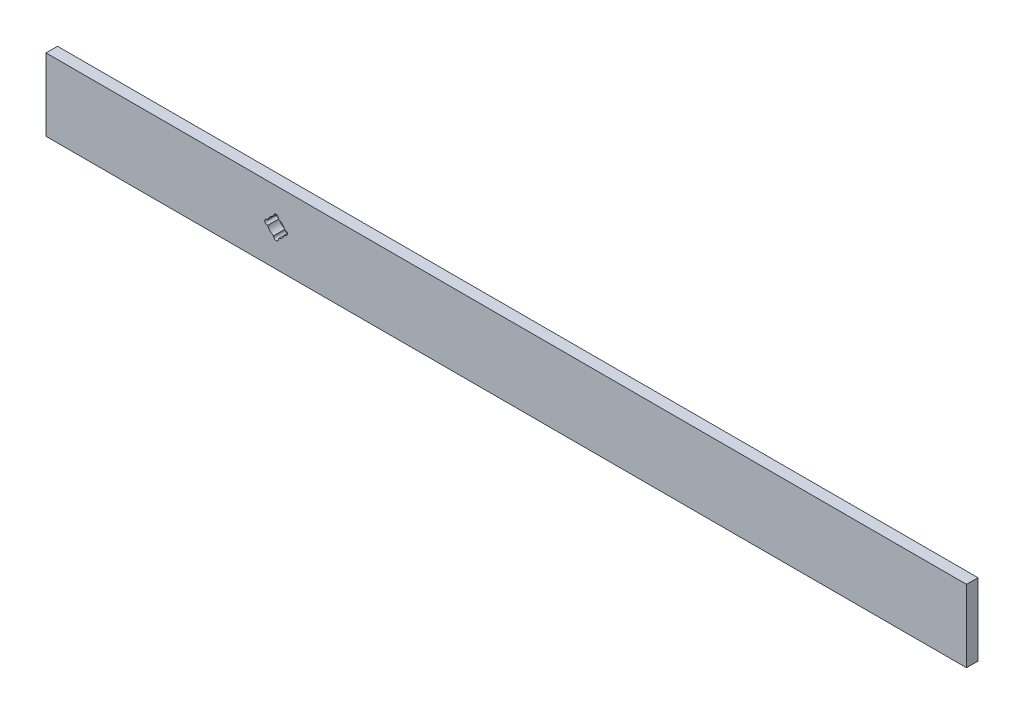
ISO-10303-21;
HEADER;
FILE_DESCRIPTION(('STEP AP214'),'2;1');
FILE_NAME('part.step','',(''),(''),'','','');
FILE_SCHEMA(('AUTOMOTIVE_DESIGN { 1 0 10303 214 1 1 1 1 }'));
ENDSEC;
DATA;
#1=APPLICATION_CONTEXT('core data for automotive mechanical design processes');
#2=APPLICATION_PROTOCOL_DEFINITION('international standard','automotive_design',2000,#1);
#3=PRODUCT_CONTEXT('',#1,'mechanical');
#4=PRODUCT('Part','Part','',(#3));
#5=PRODUCT_RELATED_PRODUCT_CATEGORY('part','',(#4));
#6=PRODUCT_DEFINITION_FORMATION('','',#4);
#7=PRODUCT_DEFINITION_CONTEXT('part definition',#1,'design');
#8=PRODUCT_DEFINITION('design','',#6,#7);
#9=PRODUCT_DEFINITION_SHAPE('','',#8);
#10=(LENGTH_UNIT() NAMED_UNIT(*) SI_UNIT(.MILLI.,.METRE.));
#11=(NAMED_UNIT(*) PLANE_ANGLE_UNIT() SI_UNIT($,.RADIAN.));
#12=(NAMED_UNIT(*) SI_UNIT($,.STERADIAN.) SOLID_ANGLE_UNIT());
#13=UNCERTAINTY_MEASURE_WITH_UNIT(LENGTH_MEASURE(1.E-05),#10,'distance_accuracy_value','');
#14=(GEOMETRIC_REPRESENTATION_CONTEXT(3) GLOBAL_UNCERTAINTY_ASSIGNED_CONTEXT((#13)) GLOBAL_UNIT_ASSIGNED_CONTEXT((#10,
#11,#12)) REPRESENTATION_CONTEXT('',''));
#15=CARTESIAN_POINT('',(0.,0.,0.));
#16=DIRECTION('',(0.,0.,1.));
#17=DIRECTION('',(1.,0.,0.));
#18=AXIS2_PLACEMENT_3D('',#15,#16,#17);
#19=CARTESIAN_POINT('',(0.,39.878,6.35));
#20=DIRECTION('',(0.,0.,-1.));
#21=DIRECTION('',(-1.,0.,0.));
#22=AXIS2_PLACEMENT_3D('',#19,#20,#21);
#23=PLANE('',#22);
#24=DIRECTION('',(0.,-1.,0.));
#25=VECTOR('',#24,1.);
#26=CARTESIAN_POINT('',(0.,0.,6.35));
#27=LINE('',#26,#25);
#28=CARTESIAN_POINT('',(0.,39.878,6.35));
#29=VERTEX_POINT('',#28);
#30=CARTESIAN_POINT('',(0.,0.,6.35));
#31=VERTEX_POINT('',#30);
#32=EDGE_CURVE('E256',#29,#31,#27,.T.);
#33=ORIENTED_EDGE('',*,*,#32,.T.);
#34=DIRECTION('',(1.,0.,0.));
#35=VECTOR('',#34,1.);
#36=CARTESIAN_POINT('',(0.,0.,6.35));
#37=LINE('',#36,#35);
#38=CARTESIAN_POINT('',(508.,0.,6.35));
#39=VERTEX_POINT('',#38);
#40=EDGE_CURVE('E259',#31,#39,#37,.T.);
#41=ORIENTED_EDGE('',*,*,#40,.T.);
#42=DIRECTION('',(0.,1.,0.));
#43=VECTOR('',#42,1.);
#44=CARTESIAN_POINT('',(508.,0.,6.35));
#45=LINE('',#44,#43);
#46=CARTESIAN_POINT('',(508.,39.878,6.35));
#47=VERTEX_POINT('',#46);
#48=EDGE_CURVE('E262',#39,#47,#45,.T.);
#49=ORIENTED_EDGE('',*,*,#48,.T.);
#50=DIRECTION('',(-1.,0.,0.));
#51=VECTOR('',#50,1.);
#52=CARTESIAN_POINT('',(0.,39.878,6.35));
#53=LINE('',#52,#51);
#54=EDGE_CURVE('E264',#47,#29,#53,.T.);
#55=ORIENTED_EDGE('',*,*,#54,.T.);
#56=EDGE_LOOP('',(#33,#41,#49,#55));
#57=FACE_BOUND('',#56,.T.);
#58=DIRECTION('',(1.,0.,0.));
#59=VECTOR('',#58,1.);
#60=CARTESIAN_POINT('',(254.,21.2852,6.35));
#61=LINE('',#60,#59);
#62=CARTESIAN_POINT('',(131.60798284719,21.2852,6.35));
#63=VERTEX_POINT('',#62);
#64=CARTESIAN_POINT('',(131.953,21.2852,6.35));
#65=VERTEX_POINT('',#64);
#66=EDGE_CURVE('E397',#63,#65,#61,.T.);
#67=ORIENTED_EDGE('',*,*,#66,.T.);
#68=CARTESIAN_POINT('',(131.953,19.939,6.35));
#69=DIRECTION('',(0.,0.,1.));
#70=DIRECTION('',(1.,0.,0.));
#71=AXIS2_PLACEMENT_3D('',#68,#69,#70);
#72=CIRCLE('',#71,1.3462);
#73=CARTESIAN_POINT('',(131.953,18.5928,6.35));
#74=VERTEX_POINT('',#73);
#75=EDGE_CURVE('E389',#74,#65,#72,.T.);
#76=ORIENTED_EDGE('',*,*,#75,.F.);
#77=DIRECTION('',(1.,0.,0.));
#78=VECTOR('',#77,1.);
#79=CARTESIAN_POINT('',(254.,18.5928,6.35));
#80=LINE('',#79,#78);
#81=CARTESIAN_POINT('',(131.60798284719,18.5928,6.35));
#82=VERTEX_POINT('',#81);
#83=EDGE_CURVE('E386',#82,#74,#80,.T.);
#84=ORIENTED_EDGE('',*,*,#83,.F.);
#85=CARTESIAN_POINT('',(127.,19.939,6.35));
#86=DIRECTION('',(0.,0.,1.));
#87=DIRECTION('',(1.,0.,0.));
#88=AXIS2_PLACEMENT_3D('',#85,#86,#87);
#89=CIRCLE('',#88,4.80060000000003);
#90=CARTESIAN_POINT('',(128.3462,15.3310171528097,6.35));
#91=VERTEX_POINT('',#90);
#92=EDGE_CURVE('E383',#82,#91,#89,.F.);
#93=ORIENTED_EDGE('',*,*,#92,.T.);
#94=DIRECTION('',(0.,-1.,0.));
#95=VECTOR('',#94,1.);
#96=CARTESIAN_POINT('',(128.3462,24.892,6.35));
#97=LINE('',#96,#95);
#98=CARTESIAN_POINT('',(128.3462,14.986,6.35));
#99=VERTEX_POINT('',#98);
#100=EDGE_CURVE('E206',#91,#99,#97,.T.);
#101=ORIENTED_EDGE('',*,*,#100,.T.);
#102=CARTESIAN_POINT('',(127.,14.986,6.35));
#103=DIRECTION('',(0.,0.,1.));
#104=DIRECTION('',(1.,0.,0.));
#105=AXIS2_PLACEMENT_3D('',#102,#103,#104);
#106=CIRCLE('',#105,1.34619999999998);
#107=CARTESIAN_POINT('',(125.6538,14.986,6.35));
#108=VERTEX_POINT('',#107);
#109=EDGE_CURVE('E242',#108,#99,#106,.T.);
#110=ORIENTED_EDGE('',*,*,#109,.F.);
#111=DIRECTION('',(0.,-1.,0.));
#112=VECTOR('',#111,1.);
#113=CARTESIAN_POINT('',(125.6538,24.892,6.35));
#114=LINE('',#113,#112);
#115=CARTESIAN_POINT('',(125.6538,15.3310171528097,6.35));
#116=VERTEX_POINT('',#115);
#117=EDGE_CURVE('E238',#116,#108,#114,.T.);
#118=ORIENTED_EDGE('',*,*,#117,.F.);
#119=CARTESIAN_POINT('',(127.,19.939,6.35));
#120=DIRECTION('',(0.,0.,1.));
#121=DIRECTION('',(1.,0.,0.));
#122=AXIS2_PLACEMENT_3D('',#119,#120,#121);
#123=CIRCLE('',#122,4.8006);
#124=CARTESIAN_POINT('',(122.39201715281,18.5928,6.35));
#125=VERTEX_POINT('',#124);
#126=EDGE_CURVE('E412',#125,#116,#123,.T.);
#127=ORIENTED_EDGE('',*,*,#126,.F.);
#128=DIRECTION('',(1.,0.,0.));
#129=VECTOR('',#128,1.);
#130=CARTESIAN_POINT('',(254.,18.5928,6.35));
#131=LINE('',#130,#129);
#132=CARTESIAN_POINT('',(122.047,18.5928,6.35));
#133=VERTEX_POINT('',#132);
#134=EDGE_CURVE('E432',#133,#125,#131,.T.);
#135=ORIENTED_EDGE('',*,*,#134,.F.);
#136=CARTESIAN_POINT('',(122.047,19.939,6.35));
#137=DIRECTION('',(0.,0.,1.));
#138=DIRECTION('',(1.,0.,0.));
#139=AXIS2_PLACEMENT_3D('',#136,#137,#138);
#140=CIRCLE('',#139,1.3462);
#141=CARTESIAN_POINT('',(122.047,21.2852,6.35));
#142=VERTEX_POINT('',#141);
#143=EDGE_CURVE('E429',#142,#133,#140,.T.);
#144=ORIENTED_EDGE('',*,*,#143,.F.);
#145=DIRECTION('',(1.,0.,0.));
#146=VECTOR('',#145,1.);
#147=CARTESIAN_POINT('',(254.,21.2852,6.35));
#148=LINE('',#147,#146);
#149=CARTESIAN_POINT('',(122.39201715281,21.2852,6.35));
#150=VERTEX_POINT('',#149);
#151=EDGE_CURVE('E426',#142,#150,#148,.T.);
#152=ORIENTED_EDGE('',*,*,#151,.T.);
#153=CARTESIAN_POINT('',(127.,19.939,6.35));
#154=DIRECTION('',(0.,0.,1.));
#155=DIRECTION('',(1.,0.,0.));
#156=AXIS2_PLACEMENT_3D('',#153,#154,#155);
#157=CIRCLE('',#156,4.8006);
#158=CARTESIAN_POINT('',(125.6538,24.5469828471903,6.35));
#159=VERTEX_POINT('',#158);
#160=EDGE_CURVE('E249',#150,#159,#157,.F.);
#161=ORIENTED_EDGE('',*,*,#160,.T.);
#162=CARTESIAN_POINT('',(125.6538,24.892,6.35));
#163=VERTEX_POINT('',#162);
#164=EDGE_CURVE('E239',#163,#159,#114,.T.);
#165=ORIENTED_EDGE('',*,*,#164,.F.);
#166=CARTESIAN_POINT('',(127.,24.892,6.35));
#167=DIRECTION('',(0.,0.,1.));
#168=DIRECTION('',(1.,0.,0.));
#169=AXIS2_PLACEMENT_3D('',#166,#167,#168);
#170=CIRCLE('',#169,1.34619999999998);
#171=CARTESIAN_POINT('',(128.3462,24.892,6.35));
#172=VERTEX_POINT('',#171);
#173=EDGE_CURVE('E235',#172,#163,#170,.T.);
#174=ORIENTED_EDGE('',*,*,#173,.F.);
#175=CARTESIAN_POINT('',(128.3462,24.5469828471903,6.35));
#176=VERTEX_POINT('',#175);
#177=EDGE_CURVE('E78',#172,#176,#97,.T.);
#178=ORIENTED_EDGE('',*,*,#177,.T.);
#179=CARTESIAN_POINT('',(127.,19.939,6.35));
#180=DIRECTION('',(0.,0.,1.));
#181=DIRECTION('',(1.,0.,0.));
#182=AXIS2_PLACEMENT_3D('',#179,#180,#181);
#183=CIRCLE('',#182,4.80060000000003);
#184=EDGE_CURVE('E220',#63,#176,#183,.T.);
#185=ORIENTED_EDGE('',*,*,#184,.F.);
#186=EDGE_LOOP('',(#67,#76,#84,#93,#101,#110,#118,#127,#135,#144,#152,#161,#165,#174,#178,#185));
#187=FACE_BOUND('',#186,.T.);
#188=ADVANCED_FACE('F63',(#57,#187),#23,.F.);
#189=CARTESIAN_POINT('',(0.,39.878,0.));
#190=DIRECTION('',(0.,0.,-1.));
#191=DIRECTION('',(-1.,0.,0.));
#192=AXIS2_PLACEMENT_3D('',#189,#190,#191);
#193=PLANE('',#192);
#194=DIRECTION('',(0.,-1.,0.));
#195=VECTOR('',#194,1.);
#196=CARTESIAN_POINT('',(0.,0.,0.));
#197=LINE('',#196,#195);
#198=CARTESIAN_POINT('',(0.,39.878,0.));
#199=VERTEX_POINT('',#198);
#200=CARTESIAN_POINT('',(0.,0.,0.));
#201=VERTEX_POINT('',#200);
#202=EDGE_CURVE('E267',#199,#201,#197,.T.);
#203=ORIENTED_EDGE('',*,*,#202,.F.);
#204=DIRECTION('',(-1.,0.,0.));
#205=VECTOR('',#204,1.);
#206=CARTESIAN_POINT('',(0.,39.878,0.));
#207=LINE('',#206,#205);
#208=CARTESIAN_POINT('',(508.,39.878,0.));
#209=VERTEX_POINT('',#208);
#210=EDGE_CURVE('E260',#209,#199,#207,.T.);
#211=ORIENTED_EDGE('',*,*,#210,.F.);
#212=DIRECTION('',(0.,1.,0.));
#213=VECTOR('',#212,1.);
#214=CARTESIAN_POINT('',(508.,0.,0.));
#215=LINE('',#214,#213);
#216=CARTESIAN_POINT('',(508.,0.,0.));
#217=VERTEX_POINT('',#216);
#218=EDGE_CURVE('E273',#217,#209,#215,.T.);
#219=ORIENTED_EDGE('',*,*,#218,.F.);
#220=DIRECTION('',(1.,0.,0.));
#221=VECTOR('',#220,1.);
#222=CARTESIAN_POINT('',(0.,0.,0.));
#223=LINE('',#222,#221);
#224=EDGE_CURVE('E270',#201,#217,#223,.T.);
#225=ORIENTED_EDGE('',*,*,#224,.F.);
#226=EDGE_LOOP('',(#203,#211,#219,#225));
#227=FACE_BOUND('',#226,.T.);
#228=CARTESIAN_POINT('',(131.953,19.939,0.));
#229=DIRECTION('',(0.,0.,1.));
#230=DIRECTION('',(1.,0.,0.));
#231=AXIS2_PLACEMENT_3D('',#228,#229,#230);
#232=CIRCLE('',#231,1.3462);
#233=CARTESIAN_POINT('',(131.953,18.5928,0.));
#234=VERTEX_POINT('',#233);
#235=CARTESIAN_POINT('',(131.953,21.2852,0.));
#236=VERTEX_POINT('',#235);
#237=EDGE_CURVE('E468',#234,#236,#232,.T.);
#238=ORIENTED_EDGE('',*,*,#237,.T.);
#239=DIRECTION('',(1.,0.,0.));
#240=VECTOR('',#239,1.);
#241=CARTESIAN_POINT('',(254.,21.2852,0.));
#242=LINE('',#241,#240);
#243=CARTESIAN_POINT('',(131.60798284719,21.2852,0.));
#244=VERTEX_POINT('',#243);
#245=EDGE_CURVE('E466',#244,#236,#242,.T.);
#246=ORIENTED_EDGE('',*,*,#245,.F.);
#247=CARTESIAN_POINT('',(127.,19.939,0.));
#248=DIRECTION('',(0.,0.,1.));
#249=DIRECTION('',(1.,0.,0.));
#250=AXIS2_PLACEMENT_3D('',#247,#248,#249);
#251=CIRCLE('',#250,4.80060000000003);
#252=CARTESIAN_POINT('',(128.3462,24.5469828471903,0.));
#253=VERTEX_POINT('',#252);
#254=EDGE_CURVE('E211',#244,#253,#251,.T.);
#255=ORIENTED_EDGE('',*,*,#254,.T.);
#256=DIRECTION('',(0.,-1.,0.));
#257=VECTOR('',#256,1.);
#258=CARTESIAN_POINT('',(128.3462,24.892,0.));
#259=LINE('',#258,#257);
#260=CARTESIAN_POINT('',(128.3462,24.892,0.));
#261=VERTEX_POINT('',#260);
#262=EDGE_CURVE('E228',#261,#253,#259,.T.);
#263=ORIENTED_EDGE('',*,*,#262,.F.);
#264=CARTESIAN_POINT('',(127.,24.892,0.));
#265=DIRECTION('',(0.,0.,1.));
#266=DIRECTION('',(1.,0.,0.));
#267=AXIS2_PLACEMENT_3D('',#264,#265,#266);
#268=CIRCLE('',#267,1.34619999999998);
#269=CARTESIAN_POINT('',(125.6538,24.892,0.));
#270=VERTEX_POINT('',#269);
#271=EDGE_CURVE('E246',#261,#270,#268,.T.);
#272=ORIENTED_EDGE('',*,*,#271,.T.);
#273=DIRECTION('',(0.,-1.,0.));
#274=VECTOR('',#273,1.);
#275=CARTESIAN_POINT('',(125.6538,24.892,0.));
#276=LINE('',#275,#274);
#277=CARTESIAN_POINT('',(125.6538,24.5469828471903,0.));
#278=VERTEX_POINT('',#277);
#279=EDGE_CURVE('E86',#270,#278,#276,.T.);
#280=ORIENTED_EDGE('',*,*,#279,.T.);
#281=CARTESIAN_POINT('',(127.,19.939,0.));
#282=DIRECTION('',(0.,0.,1.));
#283=DIRECTION('',(1.,0.,0.));
#284=AXIS2_PLACEMENT_3D('',#281,#282,#283);
#285=CIRCLE('',#284,4.8006);
#286=CARTESIAN_POINT('',(122.39201715281,21.2852,0.));
#287=VERTEX_POINT('',#286);
#288=EDGE_CURVE('E408',#287,#278,#285,.F.);
#289=ORIENTED_EDGE('',*,*,#288,.F.);
#290=DIRECTION('',(1.,0.,0.));
#291=VECTOR('',#290,1.);
#292=CARTESIAN_POINT('',(254.,21.2852,0.));
#293=LINE('',#292,#291);
#294=CARTESIAN_POINT('',(122.047,21.2852,0.));
#295=VERTEX_POINT('',#294);
#296=EDGE_CURVE('E411',#295,#287,#293,.T.);
#297=ORIENTED_EDGE('',*,*,#296,.F.);
#298=CARTESIAN_POINT('',(122.047,19.939,0.));
#299=DIRECTION('',(0.,0.,1.));
#300=DIRECTION('',(1.,0.,0.));
#301=AXIS2_PLACEMENT_3D('',#298,#299,#300);
#302=CIRCLE('',#301,1.3462);
#303=CARTESIAN_POINT('',(122.047,18.5928,0.));
#304=VERTEX_POINT('',#303);
#305=EDGE_CURVE('E414',#295,#304,#302,.T.);
#306=ORIENTED_EDGE('',*,*,#305,.T.);
#307=DIRECTION('',(1.,0.,0.));
#308=VECTOR('',#307,1.);
#309=CARTESIAN_POINT('',(254.,18.5928,0.));
#310=LINE('',#309,#308);
#311=CARTESIAN_POINT('',(122.39201715281,18.5928,0.));
#312=VERTEX_POINT('',#311);
#313=EDGE_CURVE('E417',#304,#312,#310,.T.);
#314=ORIENTED_EDGE('',*,*,#313,.T.);
#315=CARTESIAN_POINT('',(127.,19.939,0.));
#316=DIRECTION('',(0.,0.,1.));
#317=DIRECTION('',(1.,0.,0.));
#318=AXIS2_PLACEMENT_3D('',#315,#316,#317);
#319=CIRCLE('',#318,4.8006);
#320=CARTESIAN_POINT('',(125.6538,15.3310171528097,0.));
#321=VERTEX_POINT('',#320);
#322=EDGE_CURVE('E420',#312,#321,#319,.T.);
#323=ORIENTED_EDGE('',*,*,#322,.T.);
#324=CARTESIAN_POINT('',(125.6538,14.986,0.));
#325=VERTEX_POINT('',#324);
#326=EDGE_CURVE('E445',#321,#325,#276,.T.);
#327=ORIENTED_EDGE('',*,*,#326,.T.);
#328=CARTESIAN_POINT('',(127.,14.986,0.));
#329=DIRECTION('',(0.,0.,1.));
#330=DIRECTION('',(1.,0.,0.));
#331=AXIS2_PLACEMENT_3D('',#328,#329,#330);
#332=CIRCLE('',#331,1.34619999999998);
#333=CARTESIAN_POINT('',(128.3462,14.986,0.));
#334=VERTEX_POINT('',#333);
#335=EDGE_CURVE('E227',#325,#334,#332,.T.);
#336=ORIENTED_EDGE('',*,*,#335,.T.);
#337=CARTESIAN_POINT('',(128.3462,15.3310171528097,0.));
#338=VERTEX_POINT('',#337);
#339=EDGE_CURVE('E203',#338,#334,#259,.T.);
#340=ORIENTED_EDGE('',*,*,#339,.F.);
#341=CARTESIAN_POINT('',(127.,19.939,0.));
#342=DIRECTION('',(0.,0.,1.));
#343=DIRECTION('',(1.,0.,0.));
#344=AXIS2_PLACEMENT_3D('',#341,#342,#343);
#345=CIRCLE('',#344,4.80060000000003);
#346=CARTESIAN_POINT('',(131.60798284719,18.5928,0.));
#347=VERTEX_POINT('',#346);
#348=EDGE_CURVE('E214',#347,#338,#345,.F.);
#349=ORIENTED_EDGE('',*,*,#348,.F.);
#350=DIRECTION('',(1.,0.,0.));
#351=VECTOR('',#350,1.);
#352=CARTESIAN_POINT('',(254.,18.5928,0.));
#353=LINE('',#352,#351);
#354=EDGE_CURVE('E219',#347,#234,#353,.T.);
#355=ORIENTED_EDGE('',*,*,#354,.T.);
#356=EDGE_LOOP('',(#238,#246,#255,#263,#272,#280,#289,#297,#306,#314,#323,#327,#336,#340,#349,#355));
#357=FACE_BOUND('',#356,.T.);
#358=ADVANCED_FACE('F224',(#227,#357),#193,.T.);
#359=CARTESIAN_POINT('',(0.,0.,6.35));
#360=DIRECTION('',(1.,0.,0.));
#361=DIRECTION('',(0.,0.,-1.));
#362=AXIS2_PLACEMENT_3D('',#359,#360,#361);
#363=PLANE('',#362);
#364=ORIENTED_EDGE('',*,*,#202,.T.);
#365=DIRECTION('',(0.,0.,-1.));
#366=VECTOR('',#365,1.);
#367=CARTESIAN_POINT('',(0.,0.,6.35));
#368=LINE('',#367,#366);
#369=EDGE_CURVE('E12',#31,#201,#368,.T.);
#370=ORIENTED_EDGE('',*,*,#369,.F.);
#371=ORIENTED_EDGE('',*,*,#32,.F.);
#372=DIRECTION('',(0.,0.,-1.));
#373=VECTOR('',#372,1.);
#374=CARTESIAN_POINT('',(0.,39.878,6.35));
#375=LINE('',#374,#373);
#376=EDGE_CURVE('E266',#29,#199,#375,.T.);
#377=ORIENTED_EDGE('',*,*,#376,.T.);
#378=EDGE_LOOP('',(#364,#370,#371,#377));
#379=FACE_BOUND('',#378,.T.);
#380=ADVANCED_FACE('F65',(#379),#363,.F.);
#381=CARTESIAN_POINT('',(0.,0.,6.35));
#382=DIRECTION('',(0.,1.,0.));
#383=DIRECTION('',(0.,0.,1.));
#384=AXIS2_PLACEMENT_3D('',#381,#382,#383);
#385=PLANE('',#384);
#386=ORIENTED_EDGE('',*,*,#224,.T.);
#387=DIRECTION('',(0.,0.,-1.));
#388=VECTOR('',#387,1.);
#389=CARTESIAN_POINT('',(508.,0.,6.35));
#390=LINE('',#389,#388);
#391=EDGE_CURVE('E71',#39,#217,#390,.T.);
#392=ORIENTED_EDGE('',*,*,#391,.F.);
#393=ORIENTED_EDGE('',*,*,#40,.F.);
#394=ORIENTED_EDGE('',*,*,#369,.T.);
#395=EDGE_LOOP('',(#386,#392,#393,#394));
#396=FACE_BOUND('',#395,.T.);
#397=ADVANCED_FACE('F300',(#396),#385,.F.);
#398=CARTESIAN_POINT('',(508.,0.,6.35));
#399=DIRECTION('',(-1.,0.,0.));
#400=DIRECTION('',(0.,0.,1.));
#401=AXIS2_PLACEMENT_3D('',#398,#399,#400);
#402=PLANE('',#401);
#403=ORIENTED_EDGE('',*,*,#218,.T.);
#404=DIRECTION('',(0.,0.,-1.));
#405=VECTOR('',#404,1.);
#406=CARTESIAN_POINT('',(508.,39.878,6.35));
#407=LINE('',#406,#405);
#408=EDGE_CURVE('E278',#47,#209,#407,.T.);
#409=ORIENTED_EDGE('',*,*,#408,.F.);
#410=ORIENTED_EDGE('',*,*,#48,.F.);
#411=ORIENTED_EDGE('',*,*,#391,.T.);
#412=EDGE_LOOP('',(#403,#409,#410,#411));
#413=FACE_BOUND('',#412,.T.);
#414=ADVANCED_FACE('F285',(#413),#402,.F.);
#415=CARTESIAN_POINT('',(0.,39.878,6.35));
#416=DIRECTION('',(0.,-1.,0.));
#417=DIRECTION('',(0.,0.,-1.));
#418=AXIS2_PLACEMENT_3D('',#415,#416,#417);
#419=PLANE('',#418);
#420=ORIENTED_EDGE('',*,*,#210,.T.);
#421=ORIENTED_EDGE('',*,*,#376,.F.);
#422=ORIENTED_EDGE('',*,*,#54,.F.);
#423=ORIENTED_EDGE('',*,*,#408,.T.);
#424=EDGE_LOOP('',(#420,#421,#422,#423));
#425=FACE_BOUND('',#424,.T.);
#426=ADVANCED_FACE('F293',(#425),#419,.F.);
#427=CARTESIAN_POINT('',(127.,19.939,0.));
#428=DIRECTION('',(0.,0.,1.));
#429=DIRECTION('',(1.,0.,0.));
#430=AXIS2_PLACEMENT_3D('',#427,#428,#429);
#431=CYLINDRICAL_SURFACE('',#430,4.80060000000003);
#432=ORIENTED_EDGE('',*,*,#184,.T.);
#433=DIRECTION('',(0.,0.,1.));
#434=VECTOR('',#433,1.);
#435=CARTESIAN_POINT('',(128.3462,24.5469828471903,0.));
#436=LINE('',#435,#434);
#437=EDGE_CURVE('E271',#253,#176,#436,.T.);
#438=ORIENTED_EDGE('',*,*,#437,.F.);
#439=ORIENTED_EDGE('',*,*,#254,.F.);
#440=DIRECTION('',(0.,0.,1.));
#441=VECTOR('',#440,1.);
#442=CARTESIAN_POINT('',(131.60798284719,21.2852,0.));
#443=LINE('',#442,#441);
#444=EDGE_CURVE('E401',#244,#63,#443,.T.);
#445=ORIENTED_EDGE('',*,*,#444,.T.);
#446=EDGE_LOOP('',(#432,#438,#439,#445));
#447=FACE_BOUND('',#446,.T.);
#448=ADVANCED_FACE('F318',(#447),#431,.F.);
#449=CARTESIAN_POINT('',(254.,21.2852,0.));
#450=DIRECTION('',(0.,-1.,0.));
#451=DIRECTION('',(0.,0.,-1.));
#452=AXIS2_PLACEMENT_3D('',#449,#450,#451);
#453=PLANE('',#452);
#454=ORIENTED_EDGE('',*,*,#66,.F.);
#455=ORIENTED_EDGE('',*,*,#444,.F.);
#456=ORIENTED_EDGE('',*,*,#245,.T.);
#457=DIRECTION('',(0.,0.,1.));
#458=VECTOR('',#457,1.);
#459=CARTESIAN_POINT('',(131.953,21.2852,0.));
#460=LINE('',#459,#458);
#461=EDGE_CURVE('E403',#236,#65,#460,.T.);
#462=ORIENTED_EDGE('',*,*,#461,.T.);
#463=EDGE_LOOP('',(#454,#455,#456,#462));
#464=FACE_BOUND('',#463,.T.);
#465=ADVANCED_FACE('F322',(#464),#453,.T.);
#466=CARTESIAN_POINT('',(131.953,19.939,0.));
#467=DIRECTION('',(0.,0.,1.));
#468=DIRECTION('',(1.,0.,0.));
#469=AXIS2_PLACEMENT_3D('',#466,#467,#468);
#470=CYLINDRICAL_SURFACE('',#469,1.3462);
#471=ORIENTED_EDGE('',*,*,#75,.T.);
#472=ORIENTED_EDGE('',*,*,#461,.F.);
#473=ORIENTED_EDGE('',*,*,#237,.F.);
#474=DIRECTION('',(0.,0.,1.));
#475=VECTOR('',#474,1.);
#476=CARTESIAN_POINT('',(131.953,18.5928,0.));
#477=LINE('',#476,#475);
#478=EDGE_CURVE('E405',#234,#74,#477,.T.);
#479=ORIENTED_EDGE('',*,*,#478,.T.);
#480=EDGE_LOOP('',(#471,#472,#473,#479));
#481=FACE_BOUND('',#480,.T.);
#482=ADVANCED_FACE('F328',(#481),#470,.F.);
#483=CARTESIAN_POINT('',(254.,18.5928,0.));
#484=DIRECTION('',(0.,-1.,0.));
#485=DIRECTION('',(0.,0.,-1.));
#486=AXIS2_PLACEMENT_3D('',#483,#484,#485);
#487=PLANE('',#486);
#488=ORIENTED_EDGE('',*,*,#83,.T.);
#489=ORIENTED_EDGE('',*,*,#478,.F.);
#490=ORIENTED_EDGE('',*,*,#354,.F.);
#491=DIRECTION('',(0.,0.,1.));
#492=VECTOR('',#491,1.);
#493=CARTESIAN_POINT('',(131.60798284719,18.5928,0.));
#494=LINE('',#493,#492);
#495=EDGE_CURVE('E210',#347,#82,#494,.T.);
#496=ORIENTED_EDGE('',*,*,#495,.T.);
#497=EDGE_LOOP('',(#488,#489,#490,#496));
#498=FACE_BOUND('',#497,.T.);
#499=ADVANCED_FACE('F335',(#498),#487,.F.);
#500=CARTESIAN_POINT('',(127.,19.939,0.));
#501=DIRECTION('',(0.,0.,1.));
#502=DIRECTION('',(1.,0.,0.));
#503=AXIS2_PLACEMENT_3D('',#500,#501,#502);
#504=CYLINDRICAL_SURFACE('',#503,4.80060000000003);
#505=ORIENTED_EDGE('',*,*,#92,.F.);
#506=ORIENTED_EDGE('',*,*,#495,.F.);
#507=ORIENTED_EDGE('',*,*,#348,.T.);
#508=DIRECTION('',(0.,0.,1.));
#509=VECTOR('',#508,1.);
#510=CARTESIAN_POINT('',(128.3462,15.3310171528097,0.));
#511=LINE('',#510,#509);
#512=EDGE_CURVE('E199',#338,#91,#511,.T.);
#513=ORIENTED_EDGE('',*,*,#512,.T.);
#514=EDGE_LOOP('',(#505,#506,#507,#513));
#515=FACE_BOUND('',#514,.T.);
#516=ADVANCED_FACE('F215',(#515),#504,.F.);
#517=CARTESIAN_POINT('',(127.,19.939,0.));
#518=DIRECTION('',(0.,0.,1.));
#519=DIRECTION('',(1.,0.,0.));
#520=AXIS2_PLACEMENT_3D('',#517,#518,#519);
#521=CYLINDRICAL_SURFACE('',#520,4.8006);
#522=ORIENTED_EDGE('',*,*,#126,.T.);
#523=DIRECTION('',(0.,0.,1.));
#524=VECTOR('',#523,1.);
#525=CARTESIAN_POINT('',(125.6538,15.3310171528097,0.));
#526=LINE('',#525,#524);
#527=EDGE_CURVE('E377',#321,#116,#526,.T.);
#528=ORIENTED_EDGE('',*,*,#527,.F.);
#529=ORIENTED_EDGE('',*,*,#322,.F.);
#530=DIRECTION('',(0.,0.,1.));
#531=VECTOR('',#530,1.);
#532=CARTESIAN_POINT('',(122.39201715281,18.5928,0.));
#533=LINE('',#532,#531);
#534=EDGE_CURVE('E437',#312,#125,#533,.T.);
#535=ORIENTED_EDGE('',*,*,#534,.T.);
#536=EDGE_LOOP('',(#522,#528,#529,#535));
#537=FACE_BOUND('',#536,.T.);
#538=ADVANCED_FACE('F342',(#537),#521,.F.);
#539=CARTESIAN_POINT('',(254.,18.5928,0.));
#540=DIRECTION('',(0.,-1.,0.));
#541=DIRECTION('',(0.,0.,-1.));
#542=AXIS2_PLACEMENT_3D('',#539,#540,#541);
#543=PLANE('',#542);
#544=ORIENTED_EDGE('',*,*,#134,.T.);
#545=ORIENTED_EDGE('',*,*,#534,.F.);
#546=ORIENTED_EDGE('',*,*,#313,.F.);
#547=DIRECTION('',(0.,0.,1.));
#548=VECTOR('',#547,1.);
#549=CARTESIAN_POINT('',(122.047,18.5928,0.));
#550=LINE('',#549,#548);
#551=EDGE_CURVE('E439',#304,#133,#550,.T.);
#552=ORIENTED_EDGE('',*,*,#551,.T.);
#553=EDGE_LOOP('',(#544,#545,#546,#552));
#554=FACE_BOUND('',#553,.T.);
#555=ADVANCED_FACE('F345',(#554),#543,.F.);
#556=CARTESIAN_POINT('',(122.047,19.939,0.));
#557=DIRECTION('',(0.,0.,1.));
#558=DIRECTION('',(1.,0.,0.));
#559=AXIS2_PLACEMENT_3D('',#556,#557,#558);
#560=CYLINDRICAL_SURFACE('',#559,1.3462);
#561=ORIENTED_EDGE('',*,*,#143,.T.);
#562=ORIENTED_EDGE('',*,*,#551,.F.);
#563=ORIENTED_EDGE('',*,*,#305,.F.);
#564=DIRECTION('',(0.,0.,1.));
#565=VECTOR('',#564,1.);
#566=CARTESIAN_POINT('',(122.047,21.2852,0.));
#567=LINE('',#566,#565);
#568=EDGE_CURVE('E441',#295,#142,#567,.T.);
#569=ORIENTED_EDGE('',*,*,#568,.T.);
#570=EDGE_LOOP('',(#561,#562,#563,#569));
#571=FACE_BOUND('',#570,.T.);
#572=ADVANCED_FACE('F350',(#571),#560,.F.);
#573=CARTESIAN_POINT('',(254.,21.2852,0.));
#574=DIRECTION('',(0.,-1.,0.));
#575=DIRECTION('',(0.,0.,-1.));
#576=AXIS2_PLACEMENT_3D('',#573,#574,#575);
#577=PLANE('',#576);
#578=ORIENTED_EDGE('',*,*,#151,.F.);
#579=ORIENTED_EDGE('',*,*,#568,.F.);
#580=ORIENTED_EDGE('',*,*,#296,.T.);
#581=DIRECTION('',(0.,0.,1.));
#582=VECTOR('',#581,1.);
#583=CARTESIAN_POINT('',(122.39201715281,21.2852,0.));
#584=LINE('',#583,#582);
#585=EDGE_CURVE('E423',#287,#150,#584,.T.);
#586=ORIENTED_EDGE('',*,*,#585,.T.);
#587=EDGE_LOOP('',(#578,#579,#580,#586));
#588=FACE_BOUND('',#587,.T.);
#589=ADVANCED_FACE('F354',(#588),#577,.T.);
#590=CARTESIAN_POINT('',(127.,19.939,0.));
#591=DIRECTION('',(0.,0.,1.));
#592=DIRECTION('',(1.,0.,0.));
#593=AXIS2_PLACEMENT_3D('',#590,#591,#592);
#594=CYLINDRICAL_SURFACE('',#593,4.8006);
#595=ORIENTED_EDGE('',*,*,#160,.F.);
#596=ORIENTED_EDGE('',*,*,#585,.F.);
#597=ORIENTED_EDGE('',*,*,#288,.T.);
#598=DIRECTION('',(0.,0.,1.));
#599=VECTOR('',#598,1.);
#600=CARTESIAN_POINT('',(125.6538,24.5469828471903,0.));
#601=LINE('',#600,#599);
#602=EDGE_CURVE('E387',#278,#159,#601,.T.);
#603=ORIENTED_EDGE('',*,*,#602,.T.);
#604=EDGE_LOOP('',(#595,#596,#597,#603));
#605=FACE_BOUND('',#604,.T.);
#606=ADVANCED_FACE('F347',(#605),#594,.F.);
#607=CARTESIAN_POINT('',(128.3462,24.892,0.));
#608=DIRECTION('',(-1.,0.,0.));
#609=DIRECTION('',(0.,0.,1.));
#610=AXIS2_PLACEMENT_3D('',#607,#608,#609);
#611=PLANE('',#610);
#612=ORIENTED_EDGE('',*,*,#437,.T.);
#613=ORIENTED_EDGE('',*,*,#177,.F.);
#614=DIRECTION('',(0.,0.,1.));
#615=VECTOR('',#614,1.);
#616=CARTESIAN_POINT('',(128.3462,24.892,0.));
#617=LINE('',#616,#615);
#618=EDGE_CURVE('E247',#261,#172,#617,.T.);
#619=ORIENTED_EDGE('',*,*,#618,.F.);
#620=ORIENTED_EDGE('',*,*,#262,.T.);
#621=EDGE_LOOP('',(#612,#613,#619,#620));
#622=FACE_BOUND('',#621,.T.);
#623=ADVANCED_FACE('F361',(#622),#611,.T.);
#624=ORIENTED_EDGE('',*,*,#339,.T.);
#625=DIRECTION('',(0.,0.,1.));
#626=VECTOR('',#625,1.);
#627=CARTESIAN_POINT('',(128.3462,14.986,0.));
#628=LINE('',#627,#626);
#629=EDGE_CURVE('E250',#334,#99,#628,.T.);
#630=ORIENTED_EDGE('',*,*,#629,.T.);
#631=ORIENTED_EDGE('',*,*,#100,.F.);
#632=ORIENTED_EDGE('',*,*,#512,.F.);
#633=EDGE_LOOP('',(#624,#630,#631,#632));
#634=FACE_BOUND('',#633,.T.);
#635=ADVANCED_FACE('F201',(#634),#611,.T.);
#636=CARTESIAN_POINT('',(127.,14.986,0.));
#637=DIRECTION('',(0.,0.,1.));
#638=DIRECTION('',(1.,0.,0.));
#639=AXIS2_PLACEMENT_3D('',#636,#637,#638);
#640=CYLINDRICAL_SURFACE('',#639,1.34619999999998);
#641=ORIENTED_EDGE('',*,*,#109,.T.);
#642=ORIENTED_EDGE('',*,*,#629,.F.);
#643=ORIENTED_EDGE('',*,*,#335,.F.);
#644=DIRECTION('',(0.,0.,1.));
#645=VECTOR('',#644,1.);
#646=CARTESIAN_POINT('',(125.6538,14.986,0.));
#647=LINE('',#646,#645);
#648=EDGE_CURVE('E252',#325,#108,#647,.T.);
#649=ORIENTED_EDGE('',*,*,#648,.T.);
#650=EDGE_LOOP('',(#641,#642,#643,#649));
#651=FACE_BOUND('',#650,.T.);
#652=ADVANCED_FACE('F366',(#651),#640,.F.);
#653=CARTESIAN_POINT('',(125.6538,24.892,0.));
#654=DIRECTION('',(-1.,0.,0.));
#655=DIRECTION('',(0.,0.,1.));
#656=AXIS2_PLACEMENT_3D('',#653,#654,#655);
#657=PLANE('',#656);
#658=ORIENTED_EDGE('',*,*,#117,.T.);
#659=ORIENTED_EDGE('',*,*,#648,.F.);
#660=ORIENTED_EDGE('',*,*,#326,.F.);
#661=ORIENTED_EDGE('',*,*,#527,.T.);
#662=EDGE_LOOP('',(#658,#659,#660,#661));
#663=FACE_BOUND('',#662,.T.);
#664=ADVANCED_FACE('F363',(#663),#657,.F.);
#665=ORIENTED_EDGE('',*,*,#602,.F.);
#666=ORIENTED_EDGE('',*,*,#279,.F.);
#667=DIRECTION('',(0.,0.,1.));
#668=VECTOR('',#667,1.);
#669=CARTESIAN_POINT('',(125.6538,24.892,0.));
#670=LINE('',#669,#668);
#671=EDGE_CURVE('E231',#270,#163,#670,.T.);
#672=ORIENTED_EDGE('',*,*,#671,.T.);
#673=ORIENTED_EDGE('',*,*,#164,.T.);
#674=EDGE_LOOP('',(#665,#666,#672,#673));
#675=FACE_BOUND('',#674,.T.);
#676=ADVANCED_FACE('F370',(#675),#657,.F.);
#677=CARTESIAN_POINT('',(127.,24.892,0.));
#678=DIRECTION('',(0.,0.,1.));
#679=DIRECTION('',(1.,0.,0.));
#680=AXIS2_PLACEMENT_3D('',#677,#678,#679);
#681=CYLINDRICAL_SURFACE('',#680,1.34619999999998);
#682=ORIENTED_EDGE('',*,*,#173,.T.);
#683=ORIENTED_EDGE('',*,*,#671,.F.);
#684=ORIENTED_EDGE('',*,*,#271,.F.);
#685=ORIENTED_EDGE('',*,*,#618,.T.);
#686=EDGE_LOOP('',(#682,#683,#684,#685));
#687=FACE_BOUND('',#686,.T.);
#688=ADVANCED_FACE('F314',(#687),#681,.F.);
#689=CLOSED_SHELL('',(#188,#358,#380,#397,#414,#426,#448,#465,#482,#499,#516,#538,#555,#572,
#589,#606,#623,#635,#652,#664,#676,#688));
#690=MANIFOLD_SOLID_BREP('B2',#689);
#691=ADVANCED_BREP_SHAPE_REPRESENTATION('',(#18,#690),#14);
#692=SHAPE_DEFINITION_REPRESENTATION(#9,#691);
ENDSEC;
END-ISO-10303-21;
